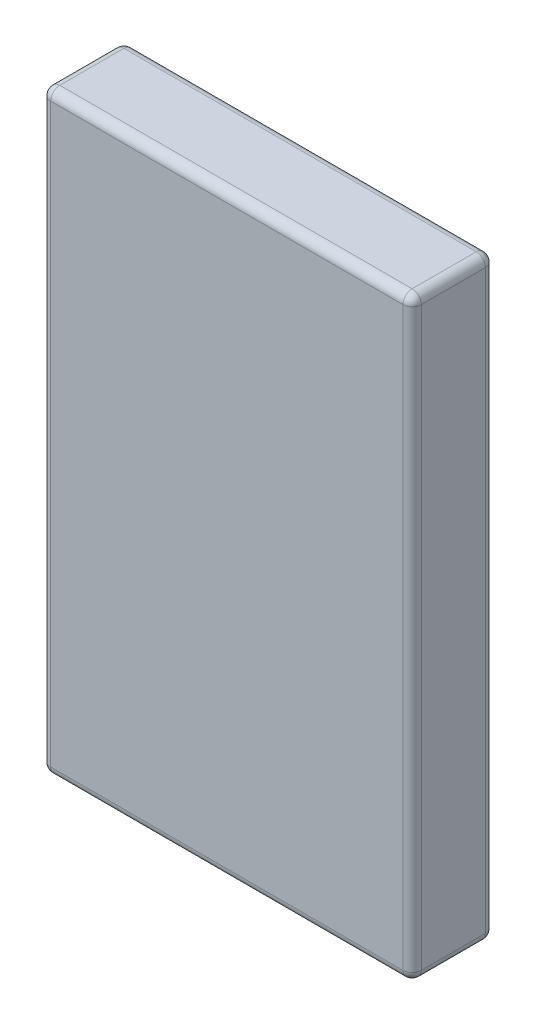
ISO-10303-21;
HEADER;
FILE_DESCRIPTION(('STEP AP214'),'2;1');
FILE_NAME('part.step','',(''),(''),'','','');
FILE_SCHEMA(('AUTOMOTIVE_DESIGN { 1 0 10303 214 1 1 1 1 }'));
ENDSEC;
DATA;
#1=APPLICATION_CONTEXT('core data for automotive mechanical design processes');
#2=APPLICATION_PROTOCOL_DEFINITION('international standard','automotive_design',2000,#1);
#3=PRODUCT_CONTEXT('',#1,'mechanical');
#4=PRODUCT('Part','Part','',(#3));
#5=PRODUCT_RELATED_PRODUCT_CATEGORY('part','',(#4));
#6=PRODUCT_DEFINITION_FORMATION('','',#4);
#7=PRODUCT_DEFINITION_CONTEXT('part definition',#1,'design');
#8=PRODUCT_DEFINITION('design','',#6,#7);
#9=PRODUCT_DEFINITION_SHAPE('','',#8);
#10=(LENGTH_UNIT() NAMED_UNIT(*) SI_UNIT(.MILLI.,.METRE.));
#11=(NAMED_UNIT(*) PLANE_ANGLE_UNIT() SI_UNIT($,.RADIAN.));
#12=(NAMED_UNIT(*) SI_UNIT($,.STERADIAN.) SOLID_ANGLE_UNIT());
#13=UNCERTAINTY_MEASURE_WITH_UNIT(LENGTH_MEASURE(1.E-05),#10,'distance_accuracy_value','');
#14=(GEOMETRIC_REPRESENTATION_CONTEXT(3) GLOBAL_UNCERTAINTY_ASSIGNED_CONTEXT((#13)) GLOBAL_UNIT_ASSIGNED_CONTEXT((#10,
#11,#12)) REPRESENTATION_CONTEXT('',''));
#15=CARTESIAN_POINT('',(0.,0.,0.));
#16=DIRECTION('',(0.,0.,1.));
#17=DIRECTION('',(1.,0.,0.));
#18=AXIS2_PLACEMENT_3D('',#15,#16,#17);
#19=CARTESIAN_POINT('',(81.,260.,-18.));
#20=DIRECTION('',(-1.,0.,0.));
#21=DIRECTION('',(0.,0.,1.));
#22=AXIS2_PLACEMENT_3D('',#19,#20,#21);
#23=PLANE('',#22);
#24=DIRECTION('',(0.,0.,-1.));
#25=VECTOR('',#24,1.);
#26=CARTESIAN_POINT('',(81.,4.,-18.));
#27=LINE('',#26,#25);
#28=CARTESIAN_POINT('',(81.,4.,14.));
#29=VERTEX_POINT('',#28);
#30=CARTESIAN_POINT('',(81.,4.,-14.));
#31=VERTEX_POINT('',#30);
#32=EDGE_CURVE('E43',#29,#31,#27,.T.);
#33=ORIENTED_EDGE('',*,*,#32,.T.);
#34=DIRECTION('',(0.,-1.,0.));
#35=VECTOR('',#34,1.);
#36=CARTESIAN_POINT('',(81.,260.,-14.));
#37=LINE('',#36,#35);
#38=CARTESIAN_POINT('',(81.,256.,-14.));
#39=VERTEX_POINT('',#38);
#40=EDGE_CURVE('E11',#31,#39,#37,.F.);
#41=ORIENTED_EDGE('',*,*,#40,.T.);
#42=DIRECTION('',(0.,0.,-1.));
#43=VECTOR('',#42,1.);
#44=CARTESIAN_POINT('',(81.,256.,18.));
#45=LINE('',#44,#43);
#46=CARTESIAN_POINT('',(81.,256.,14.));
#47=VERTEX_POINT('',#46);
#48=EDGE_CURVE('E201',#39,#47,#45,.F.);
#49=ORIENTED_EDGE('',*,*,#48,.T.);
#50=DIRECTION('',(0.,-1.,0.));
#51=VECTOR('',#50,1.);
#52=CARTESIAN_POINT('',(81.,260.,14.));
#53=LINE('',#52,#51);
#54=EDGE_CURVE('E199',#47,#29,#53,.T.);
#55=ORIENTED_EDGE('',*,*,#54,.T.);
#56=EDGE_LOOP('',(#33,#41,#49,#55));
#57=FACE_BOUND('',#56,.T.);
#58=ADVANCED_FACE('F34',(#57),#23,.F.);
#59=CARTESIAN_POINT('',(-81.,260.,-18.));
#60=DIRECTION('',(0.,0.,1.));
#61=DIRECTION('',(1.,0.,0.));
#62=AXIS2_PLACEMENT_3D('',#59,#60,#61);
#63=PLANE('',#62);
#64=DIRECTION('',(-1.,0.,0.));
#65=VECTOR('',#64,1.);
#66=CARTESIAN_POINT('',(-81.,4.,-18.));
#67=LINE('',#66,#65);
#68=CARTESIAN_POINT('',(77.,4.,-18.));
#69=VERTEX_POINT('',#68);
#70=CARTESIAN_POINT('',(-77.,4.,-18.));
#71=VERTEX_POINT('',#70);
#72=EDGE_CURVE('E169',#69,#71,#67,.T.);
#73=ORIENTED_EDGE('',*,*,#72,.T.);
#74=DIRECTION('',(0.,-1.,0.));
#75=VECTOR('',#74,1.);
#76=CARTESIAN_POINT('',(-77.,260.,-18.));
#77=LINE('',#76,#75);
#78=CARTESIAN_POINT('',(-77.,256.,-18.));
#79=VERTEX_POINT('',#78);
#80=EDGE_CURVE('E133',#71,#79,#77,.F.);
#81=ORIENTED_EDGE('',*,*,#80,.T.);
#82=DIRECTION('',(-1.,0.,0.));
#83=VECTOR('',#82,1.);
#84=CARTESIAN_POINT('',(81.,256.,-18.));
#85=LINE('',#84,#83);
#86=CARTESIAN_POINT('',(77.,256.,-18.));
#87=VERTEX_POINT('',#86);
#88=EDGE_CURVE('E161',#79,#87,#85,.F.);
#89=ORIENTED_EDGE('',*,*,#88,.T.);
#90=DIRECTION('',(0.,-1.,0.));
#91=VECTOR('',#90,1.);
#92=CARTESIAN_POINT('',(77.,260.,-18.));
#93=LINE('',#92,#91);
#94=EDGE_CURVE('E163',#87,#69,#93,.T.);
#95=ORIENTED_EDGE('',*,*,#94,.T.);
#96=EDGE_LOOP('',(#73,#81,#89,#95));
#97=FACE_BOUND('',#96,.T.);
#98=ADVANCED_FACE('F301',(#97),#63,.F.);
#99=CARTESIAN_POINT('',(-81.,260.,-18.));
#100=DIRECTION('',(1.,0.,0.));
#101=DIRECTION('',(0.,0.,-1.));
#102=AXIS2_PLACEMENT_3D('',#99,#100,#101);
#103=PLANE('',#102);
#104=DIRECTION('',(0.,0.,1.));
#105=VECTOR('',#104,1.);
#106=CARTESIAN_POINT('',(-81.,256.,-18.));
#107=LINE('',#106,#105);
#108=CARTESIAN_POINT('',(-81.,256.,14.));
#109=VERTEX_POINT('',#108);
#110=CARTESIAN_POINT('',(-81.,256.,-14.));
#111=VERTEX_POINT('',#110);
#112=EDGE_CURVE('E159',#109,#111,#107,.F.);
#113=ORIENTED_EDGE('',*,*,#112,.T.);
#114=DIRECTION('',(0.,-1.,0.));
#115=VECTOR('',#114,1.);
#116=CARTESIAN_POINT('',(-81.,260.,-14.));
#117=LINE('',#116,#115);
#118=CARTESIAN_POINT('',(-81.,4.,-14.));
#119=VERTEX_POINT('',#118);
#120=EDGE_CURVE('E131',#111,#119,#117,.T.);
#121=ORIENTED_EDGE('',*,*,#120,.T.);
#122=DIRECTION('',(0.,0.,1.));
#123=VECTOR('',#122,1.);
#124=CARTESIAN_POINT('',(-81.,4.,-18.));
#125=LINE('',#124,#123);
#126=CARTESIAN_POINT('',(-81.,4.,14.));
#127=VERTEX_POINT('',#126);
#128=EDGE_CURVE('E149',#119,#127,#125,.T.);
#129=ORIENTED_EDGE('',*,*,#128,.T.);
#130=DIRECTION('',(0.,-1.,0.));
#131=VECTOR('',#130,1.);
#132=CARTESIAN_POINT('',(-81.,260.,14.));
#133=LINE('',#132,#131);
#134=EDGE_CURVE('E155',#127,#109,#133,.F.);
#135=ORIENTED_EDGE('',*,*,#134,.T.);
#136=EDGE_LOOP('',(#113,#121,#129,#135));
#137=FACE_BOUND('',#136,.T.);
#138=ADVANCED_FACE('F157',(#137),#103,.F.);
#139=CARTESIAN_POINT('',(-81.,260.,18.));
#140=DIRECTION('',(0.,0.,-1.));
#141=DIRECTION('',(-1.,0.,0.));
#142=AXIS2_PLACEMENT_3D('',#139,#140,#141);
#143=PLANE('',#142);
#144=DIRECTION('',(1.,0.,0.));
#145=VECTOR('',#144,1.);
#146=CARTESIAN_POINT('',(-81.,256.,18.));
#147=LINE('',#146,#145);
#148=CARTESIAN_POINT('',(77.,256.,18.));
#149=VERTEX_POINT('',#148);
#150=CARTESIAN_POINT('',(-77.,256.,18.));
#151=VERTEX_POINT('',#150);
#152=EDGE_CURVE('E181',#149,#151,#147,.F.);
#153=ORIENTED_EDGE('',*,*,#152,.T.);
#154=DIRECTION('',(0.,-1.,0.));
#155=VECTOR('',#154,1.);
#156=CARTESIAN_POINT('',(-77.,260.,18.));
#157=LINE('',#156,#155);
#158=CARTESIAN_POINT('',(-77.,4.,18.));
#159=VERTEX_POINT('',#158);
#160=EDGE_CURVE('E187',#151,#159,#157,.T.);
#161=ORIENTED_EDGE('',*,*,#160,.T.);
#162=DIRECTION('',(1.,0.,0.));
#163=VECTOR('',#162,1.);
#164=CARTESIAN_POINT('',(-81.,4.,18.));
#165=LINE('',#164,#163);
#166=CARTESIAN_POINT('',(77.,4.,18.));
#167=VERTEX_POINT('',#166);
#168=EDGE_CURVE('E185',#159,#167,#165,.T.);
#169=ORIENTED_EDGE('',*,*,#168,.T.);
#170=DIRECTION('',(0.,-1.,0.));
#171=VECTOR('',#170,1.);
#172=CARTESIAN_POINT('',(77.,260.,18.));
#173=LINE('',#172,#171);
#174=EDGE_CURVE('E183',#167,#149,#173,.F.);
#175=ORIENTED_EDGE('',*,*,#174,.T.);
#176=EDGE_LOOP('',(#153,#161,#169,#175));
#177=FACE_BOUND('',#176,.T.);
#178=ADVANCED_FACE('F283',(#177),#143,.F.);
#179=CARTESIAN_POINT('',(0.,260.,0.));
#180=DIRECTION('',(0.,1.,0.));
#181=DIRECTION('',(0.,0.,1.));
#182=AXIS2_PLACEMENT_3D('',#179,#180,#181);
#183=PLANE('',#182);
#184=DIRECTION('',(0.,0.,-1.));
#185=VECTOR('',#184,1.);
#186=CARTESIAN_POINT('',(77.,260.,-18.));
#187=LINE('',#186,#185);
#188=CARTESIAN_POINT('',(77.,260.,14.));
#189=VERTEX_POINT('',#188);
#190=CARTESIAN_POINT('',(77.,260.,-14.));
#191=VERTEX_POINT('',#190);
#192=EDGE_CURVE('E174',#189,#191,#187,.T.);
#193=ORIENTED_EDGE('',*,*,#192,.T.);
#194=DIRECTION('',(-1.,0.,0.));
#195=VECTOR('',#194,1.);
#196=CARTESIAN_POINT('',(-81.,260.,-14.));
#197=LINE('',#196,#195);
#198=CARTESIAN_POINT('',(-77.,260.,-14.));
#199=VERTEX_POINT('',#198);
#200=EDGE_CURVE('E179',#191,#199,#197,.T.);
#201=ORIENTED_EDGE('',*,*,#200,.T.);
#202=DIRECTION('',(0.,0.,1.));
#203=VECTOR('',#202,1.);
#204=CARTESIAN_POINT('',(-77.,260.,18.));
#205=LINE('',#204,#203);
#206=CARTESIAN_POINT('',(-77.,260.,14.));
#207=VERTEX_POINT('',#206);
#208=EDGE_CURVE('E176',#199,#207,#205,.T.);
#209=ORIENTED_EDGE('',*,*,#208,.T.);
#210=DIRECTION('',(1.,0.,0.));
#211=VECTOR('',#210,1.);
#212=CARTESIAN_POINT('',(81.,260.,14.));
#213=LINE('',#212,#211);
#214=EDGE_CURVE('E172',#207,#189,#213,.T.);
#215=ORIENTED_EDGE('',*,*,#214,.T.);
#216=EDGE_LOOP('',(#193,#201,#209,#215));
#217=FACE_BOUND('',#216,.T.);
#218=ADVANCED_FACE('F274',(#217),#183,.T.);
#219=CARTESIAN_POINT('',(0.,0.,0.));
#220=DIRECTION('',(0.,1.,0.));
#221=DIRECTION('',(0.,0.,1.));
#222=AXIS2_PLACEMENT_3D('',#219,#220,#221);
#223=PLANE('',#222);
#224=DIRECTION('',(0.,0.,1.));
#225=VECTOR('',#224,1.);
#226=CARTESIAN_POINT('',(-77.,0.,0.));
#227=LINE('',#226,#225);
#228=CARTESIAN_POINT('',(-77.,0.,14.));
#229=VERTEX_POINT('',#228);
#230=CARTESIAN_POINT('',(-77.,0.,-14.));
#231=VERTEX_POINT('',#230);
#232=EDGE_CURVE('E194',#229,#231,#227,.F.);
#233=ORIENTED_EDGE('',*,*,#232,.T.);
#234=DIRECTION('',(-1.,0.,0.));
#235=VECTOR('',#234,1.);
#236=CARTESIAN_POINT('',(0.,0.,-14.));
#237=LINE('',#236,#235);
#238=CARTESIAN_POINT('',(77.,0.,-14.));
#239=VERTEX_POINT('',#238);
#240=EDGE_CURVE('E197',#231,#239,#237,.F.);
#241=ORIENTED_EDGE('',*,*,#240,.T.);
#242=DIRECTION('',(0.,0.,-1.));
#243=VECTOR('',#242,1.);
#244=CARTESIAN_POINT('',(77.,0.,0.));
#245=LINE('',#244,#243);
#246=CARTESIAN_POINT('',(77.,0.,14.));
#247=VERTEX_POINT('',#246);
#248=EDGE_CURVE('E192',#239,#247,#245,.F.);
#249=ORIENTED_EDGE('',*,*,#248,.T.);
#250=DIRECTION('',(1.,0.,0.));
#251=VECTOR('',#250,1.);
#252=CARTESIAN_POINT('',(0.,0.,14.));
#253=LINE('',#252,#251);
#254=EDGE_CURVE('E190',#247,#229,#253,.F.);
#255=ORIENTED_EDGE('',*,*,#254,.T.);
#256=EDGE_LOOP('',(#233,#241,#249,#255));
#257=FACE_BOUND('',#256,.T.);
#258=ADVANCED_FACE('F365',(#257),#223,.F.);
#259=CARTESIAN_POINT('',(77.,260.,14.));
#260=DIRECTION('',(0.,-1.,0.));
#261=DIRECTION('',(0.,0.,-1.));
#262=AXIS2_PLACEMENT_3D('',#259,#260,#261);
#263=CYLINDRICAL_SURFACE('',#262,4.);
#264=CARTESIAN_POINT('',(77.,256.,14.));
#265=DIRECTION('',(0.,1.,0.));
#266=DIRECTION('',(0.,0.,1.));
#267=AXIS2_PLACEMENT_3D('',#264,#265,#266);
#268=CIRCLE('',#267,4.);
#269=EDGE_CURVE('E38',#149,#47,#268,.T.);
#270=ORIENTED_EDGE('',*,*,#269,.F.);
#271=ORIENTED_EDGE('',*,*,#174,.F.);
#272=CARTESIAN_POINT('',(77.,4.,14.));
#273=DIRECTION('',(0.,-1.,0.));
#274=DIRECTION('',(0.,0.,-1.));
#275=AXIS2_PLACEMENT_3D('',#272,#273,#274);
#276=CIRCLE('',#275,4.);
#277=EDGE_CURVE('E251',#29,#167,#276,.T.);
#278=ORIENTED_EDGE('',*,*,#277,.F.);
#279=ORIENTED_EDGE('',*,*,#54,.F.);
#280=EDGE_LOOP('',(#270,#271,#278,#279));
#281=FACE_BOUND('',#280,.T.);
#282=ADVANCED_FACE('F36',(#281),#263,.T.);
#283=CARTESIAN_POINT('',(77.,256.,14.));
#284=DIRECTION('',(0.,0.,1.));
#285=DIRECTION('',(1.,0.,0.));
#286=AXIS2_PLACEMENT_3D('',#283,#284,#285);
#287=SPHERICAL_SURFACE('',#286,4.);
#288=CARTESIAN_POINT('',(77.,256.,14.));
#289=DIRECTION('',(1.,0.,0.));
#290=DIRECTION('',(0.,0.,-1.));
#291=AXIS2_PLACEMENT_3D('',#288,#289,#290);
#292=CIRCLE('',#291,4.);
#293=EDGE_CURVE('E246',#149,#189,#292,.F.);
#294=ORIENTED_EDGE('',*,*,#293,.F.);
#295=ORIENTED_EDGE('',*,*,#269,.T.);
#296=CARTESIAN_POINT('',(77.,256.,14.));
#297=DIRECTION('',(0.,0.,1.));
#298=DIRECTION('',(0.,-1.,0.));
#299=AXIS2_PLACEMENT_3D('',#296,#297,#298);
#300=CIRCLE('',#299,4.);
#301=EDGE_CURVE('E249',#189,#47,#300,.F.);
#302=ORIENTED_EDGE('',*,*,#301,.F.);
#303=EDGE_LOOP('',(#294,#295,#302));
#304=FACE_BOUND('',#303,.T.);
#305=ADVANCED_FACE('F262',(#304),#287,.T.);
#306=CARTESIAN_POINT('',(77.,4.,14.));
#307=DIRECTION('',(0.,0.,1.));
#308=DIRECTION('',(1.,0.,0.));
#309=AXIS2_PLACEMENT_3D('',#306,#307,#308);
#310=SPHERICAL_SURFACE('',#309,4.);
#311=CARTESIAN_POINT('',(77.,4.,14.));
#312=DIRECTION('',(0.,0.,1.));
#313=DIRECTION('',(1.,0.,0.));
#314=AXIS2_PLACEMENT_3D('',#311,#312,#313);
#315=CIRCLE('',#314,4.);
#316=EDGE_CURVE('E240',#29,#247,#315,.F.);
#317=ORIENTED_EDGE('',*,*,#316,.F.);
#318=ORIENTED_EDGE('',*,*,#277,.T.);
#319=CARTESIAN_POINT('',(77.,4.,14.));
#320=DIRECTION('',(1.,0.,0.));
#321=DIRECTION('',(0.,0.,-1.));
#322=AXIS2_PLACEMENT_3D('',#319,#320,#321);
#323=CIRCLE('',#322,4.);
#324=EDGE_CURVE('E243',#247,#167,#323,.F.);
#325=ORIENTED_EDGE('',*,*,#324,.F.);
#326=EDGE_LOOP('',(#317,#318,#325));
#327=FACE_BOUND('',#326,.T.);
#328=ADVANCED_FACE('F296',(#327),#310,.T.);
#329=CARTESIAN_POINT('',(77.,256.,0.));
#330=DIRECTION('',(0.,0.,1.));
#331=DIRECTION('',(1.,0.,0.));
#332=AXIS2_PLACEMENT_3D('',#329,#330,#331);
#333=CYLINDRICAL_SURFACE('',#332,4.);
#334=ORIENTED_EDGE('',*,*,#301,.T.);
#335=ORIENTED_EDGE('',*,*,#48,.F.);
#336=CARTESIAN_POINT('',(77.,256.,-14.));
#337=DIRECTION('',(0.,0.,-1.));
#338=DIRECTION('',(-1.,0.,0.));
#339=AXIS2_PLACEMENT_3D('',#336,#337,#338);
#340=CIRCLE('',#339,4.);
#341=EDGE_CURVE('E234',#191,#39,#340,.T.);
#342=ORIENTED_EDGE('',*,*,#341,.F.);
#343=ORIENTED_EDGE('',*,*,#192,.F.);
#344=EDGE_LOOP('',(#334,#335,#342,#343));
#345=FACE_BOUND('',#344,.T.);
#346=ADVANCED_FACE('F269',(#345),#333,.T.);
#347=CARTESIAN_POINT('',(0.,256.,14.));
#348=DIRECTION('',(-1.,0.,0.));
#349=DIRECTION('',(0.,0.,1.));
#350=AXIS2_PLACEMENT_3D('',#347,#348,#349);
#351=CYLINDRICAL_SURFACE('',#350,4.);
#352=ORIENTED_EDGE('',*,*,#293,.T.);
#353=ORIENTED_EDGE('',*,*,#214,.F.);
#354=CARTESIAN_POINT('',(-77.,256.,14.));
#355=DIRECTION('',(-1.,0.,0.));
#356=DIRECTION('',(0.,0.,1.));
#357=AXIS2_PLACEMENT_3D('',#354,#355,#356);
#358=CIRCLE('',#357,4.);
#359=EDGE_CURVE('E231',#151,#207,#358,.T.);
#360=ORIENTED_EDGE('',*,*,#359,.F.);
#361=ORIENTED_EDGE('',*,*,#152,.F.);
#362=EDGE_LOOP('',(#352,#353,#360,#361));
#363=FACE_BOUND('',#362,.T.);
#364=ADVANCED_FACE('F280',(#363),#351,.T.);
#365=CARTESIAN_POINT('',(-77.,260.,14.));
#366=DIRECTION('',(0.,-1.,0.));
#367=DIRECTION('',(0.,0.,-1.));
#368=AXIS2_PLACEMENT_3D('',#365,#366,#367);
#369=CYLINDRICAL_SURFACE('',#368,4.);
#370=CARTESIAN_POINT('',(-77.,4.,14.));
#371=DIRECTION('',(0.,-1.,0.));
#372=DIRECTION('',(0.,0.,-1.));
#373=AXIS2_PLACEMENT_3D('',#370,#371,#372);
#374=CIRCLE('',#373,4.);
#375=EDGE_CURVE('E225',#159,#127,#374,.T.);
#376=ORIENTED_EDGE('',*,*,#375,.F.);
#377=ORIENTED_EDGE('',*,*,#160,.F.);
#378=CARTESIAN_POINT('',(-77.,256.,14.));
#379=DIRECTION('',(0.,1.,0.));
#380=DIRECTION('',(0.,0.,1.));
#381=AXIS2_PLACEMENT_3D('',#378,#379,#380);
#382=CIRCLE('',#381,4.);
#383=EDGE_CURVE('E228',#109,#151,#382,.T.);
#384=ORIENTED_EDGE('',*,*,#383,.F.);
#385=ORIENTED_EDGE('',*,*,#134,.F.);
#386=EDGE_LOOP('',(#376,#377,#384,#385));
#387=FACE_BOUND('',#386,.T.);
#388=ADVANCED_FACE('F287',(#387),#369,.T.);
#389=CARTESIAN_POINT('',(-81.,4.,14.));
#390=DIRECTION('',(1.,0.,0.));
#391=DIRECTION('',(0.,0.,-1.));
#392=AXIS2_PLACEMENT_3D('',#389,#390,#391);
#393=CYLINDRICAL_SURFACE('',#392,4.);
#394=ORIENTED_EDGE('',*,*,#324,.T.);
#395=ORIENTED_EDGE('',*,*,#168,.F.);
#396=CARTESIAN_POINT('',(-77.,4.,14.));
#397=DIRECTION('',(-1.,0.,0.));
#398=DIRECTION('',(0.,0.,1.));
#399=AXIS2_PLACEMENT_3D('',#396,#397,#398);
#400=CIRCLE('',#399,4.);
#401=EDGE_CURVE('E223',#229,#159,#400,.T.);
#402=ORIENTED_EDGE('',*,*,#401,.F.);
#403=ORIENTED_EDGE('',*,*,#254,.F.);
#404=EDGE_LOOP('',(#394,#395,#402,#403));
#405=FACE_BOUND('',#404,.T.);
#406=ADVANCED_FACE('F293',(#405),#393,.T.);
#407=CARTESIAN_POINT('',(77.,4.,-18.));
#408=DIRECTION('',(0.,0.,-1.));
#409=DIRECTION('',(-1.,0.,0.));
#410=AXIS2_PLACEMENT_3D('',#407,#408,#409);
#411=CYLINDRICAL_SURFACE('',#410,4.);
#412=ORIENTED_EDGE('',*,*,#316,.T.);
#413=ORIENTED_EDGE('',*,*,#248,.F.);
#414=CARTESIAN_POINT('',(77.,4.,-14.));
#415=DIRECTION('',(0.,0.,-1.));
#416=DIRECTION('',(-1.,0.,0.));
#417=AXIS2_PLACEMENT_3D('',#414,#415,#416);
#418=CIRCLE('',#417,4.);
#419=EDGE_CURVE('E221',#31,#239,#418,.T.);
#420=ORIENTED_EDGE('',*,*,#419,.F.);
#421=ORIENTED_EDGE('',*,*,#32,.F.);
#422=EDGE_LOOP('',(#412,#413,#420,#421));
#423=FACE_BOUND('',#422,.T.);
#424=ADVANCED_FACE('F299',(#423),#411,.T.);
#425=CARTESIAN_POINT('',(77.,260.,-14.));
#426=DIRECTION('',(0.,-1.,0.));
#427=DIRECTION('',(0.,0.,-1.));
#428=AXIS2_PLACEMENT_3D('',#425,#426,#427);
#429=CYLINDRICAL_SURFACE('',#428,4.);
#430=CARTESIAN_POINT('',(77.,256.,-14.));
#431=DIRECTION('',(0.,1.,0.));
#432=DIRECTION('',(0.,0.,1.));
#433=AXIS2_PLACEMENT_3D('',#430,#431,#432);
#434=CIRCLE('',#433,4.);
#435=EDGE_CURVE('E237',#39,#87,#434,.T.);
#436=ORIENTED_EDGE('',*,*,#435,.F.);
#437=ORIENTED_EDGE('',*,*,#40,.F.);
#438=CARTESIAN_POINT('',(77.,4.,-14.));
#439=DIRECTION('',(0.,-1.,0.));
#440=DIRECTION('',(0.,0.,-1.));
#441=AXIS2_PLACEMENT_3D('',#438,#439,#440);
#442=CIRCLE('',#441,4.);
#443=EDGE_CURVE('E51',#69,#31,#442,.T.);
#444=ORIENTED_EDGE('',*,*,#443,.F.);
#445=ORIENTED_EDGE('',*,*,#94,.F.);
#446=EDGE_LOOP('',(#436,#437,#444,#445));
#447=FACE_BOUND('',#446,.T.);
#448=ADVANCED_FACE('F345',(#447),#429,.T.);
#449=CARTESIAN_POINT('',(77.,256.,-14.));
#450=DIRECTION('',(0.,0.,1.));
#451=DIRECTION('',(1.,0.,0.));
#452=AXIS2_PLACEMENT_3D('',#449,#450,#451);
#453=SPHERICAL_SURFACE('',#452,4.);
#454=ORIENTED_EDGE('',*,*,#341,.T.);
#455=ORIENTED_EDGE('',*,*,#435,.T.);
#456=CARTESIAN_POINT('',(77.,256.,-14.));
#457=DIRECTION('',(1.,0.,0.));
#458=DIRECTION('',(0.,0.,-1.));
#459=AXIS2_PLACEMENT_3D('',#456,#457,#458);
#460=CIRCLE('',#459,4.);
#461=EDGE_CURVE('E217',#191,#87,#460,.F.);
#462=ORIENTED_EDGE('',*,*,#461,.F.);
#463=EDGE_LOOP('',(#454,#455,#462));
#464=FACE_BOUND('',#463,.T.);
#465=ADVANCED_FACE('F341',(#464),#453,.T.);
#466=CARTESIAN_POINT('',(-77.,256.,14.));
#467=DIRECTION('',(0.,0.,1.));
#468=DIRECTION('',(1.,0.,0.));
#469=AXIS2_PLACEMENT_3D('',#466,#467,#468);
#470=SPHERICAL_SURFACE('',#469,4.);
#471=ORIENTED_EDGE('',*,*,#383,.T.);
#472=ORIENTED_EDGE('',*,*,#359,.T.);
#473=CARTESIAN_POINT('',(-77.,256.,14.));
#474=DIRECTION('',(0.,0.,1.));
#475=DIRECTION('',(1.,0.,0.));
#476=AXIS2_PLACEMENT_3D('',#473,#474,#475);
#477=CIRCLE('',#476,4.);
#478=EDGE_CURVE('E215',#109,#207,#477,.F.);
#479=ORIENTED_EDGE('',*,*,#478,.F.);
#480=EDGE_LOOP('',(#471,#472,#479));
#481=FACE_BOUND('',#480,.T.);
#482=ADVANCED_FACE('F338',(#481),#470,.T.);
#483=CARTESIAN_POINT('',(-77.,4.,14.));
#484=DIRECTION('',(0.,0.,1.));
#485=DIRECTION('',(1.,0.,0.));
#486=AXIS2_PLACEMENT_3D('',#483,#484,#485);
#487=SPHERICAL_SURFACE('',#486,4.);
#488=ORIENTED_EDGE('',*,*,#401,.T.);
#489=ORIENTED_EDGE('',*,*,#375,.T.);
#490=CARTESIAN_POINT('',(-77.,4.,14.));
#491=DIRECTION('',(0.,0.,1.));
#492=DIRECTION('',(1.,0.,0.));
#493=AXIS2_PLACEMENT_3D('',#490,#491,#492);
#494=CIRCLE('',#493,4.);
#495=EDGE_CURVE('E152',#229,#127,#494,.F.);
#496=ORIENTED_EDGE('',*,*,#495,.F.);
#497=EDGE_LOOP('',(#488,#489,#496));
#498=FACE_BOUND('',#497,.T.);
#499=ADVANCED_FACE('F335',(#498),#487,.T.);
#500=CARTESIAN_POINT('',(77.,4.,-14.));
#501=DIRECTION('',(0.,0.,1.));
#502=DIRECTION('',(1.,0.,0.));
#503=AXIS2_PLACEMENT_3D('',#500,#501,#502);
#504=SPHERICAL_SURFACE('',#503,4.);
#505=ORIENTED_EDGE('',*,*,#443,.T.);
#506=ORIENTED_EDGE('',*,*,#419,.T.);
#507=CARTESIAN_POINT('',(77.,4.,-14.));
#508=DIRECTION('',(1.,0.,0.));
#509=DIRECTION('',(0.,0.,-1.));
#510=AXIS2_PLACEMENT_3D('',#507,#508,#509);
#511=CIRCLE('',#510,4.);
#512=EDGE_CURVE('E211',#69,#239,#511,.F.);
#513=ORIENTED_EDGE('',*,*,#512,.F.);
#514=EDGE_LOOP('',(#505,#506,#513));
#515=FACE_BOUND('',#514,.T.);
#516=ADVANCED_FACE('F331',(#515),#504,.T.);
#517=CARTESIAN_POINT('',(0.,256.,-14.));
#518=DIRECTION('',(1.,0.,0.));
#519=DIRECTION('',(0.,0.,-1.));
#520=AXIS2_PLACEMENT_3D('',#517,#518,#519);
#521=CYLINDRICAL_SURFACE('',#520,4.);
#522=ORIENTED_EDGE('',*,*,#461,.T.);
#523=ORIENTED_EDGE('',*,*,#88,.F.);
#524=CARTESIAN_POINT('',(-77.,256.,-14.));
#525=DIRECTION('',(-1.,0.,0.));
#526=DIRECTION('',(0.,0.,1.));
#527=AXIS2_PLACEMENT_3D('',#524,#525,#526);
#528=CIRCLE('',#527,4.);
#529=EDGE_CURVE('E208',#199,#79,#528,.T.);
#530=ORIENTED_EDGE('',*,*,#529,.F.);
#531=ORIENTED_EDGE('',*,*,#200,.F.);
#532=EDGE_LOOP('',(#522,#523,#530,#531));
#533=FACE_BOUND('',#532,.T.);
#534=ADVANCED_FACE('F327',(#533),#521,.T.);
#535=CARTESIAN_POINT('',(-77.,256.,0.));
#536=DIRECTION('',(0.,0.,-1.));
#537=DIRECTION('',(-1.,0.,0.));
#538=AXIS2_PLACEMENT_3D('',#535,#536,#537);
#539=CYLINDRICAL_SURFACE('',#538,4.);
#540=ORIENTED_EDGE('',*,*,#478,.T.);
#541=ORIENTED_EDGE('',*,*,#208,.F.);
#542=CARTESIAN_POINT('',(-77.,256.,-14.));
#543=DIRECTION('',(0.,0.,-1.));
#544=DIRECTION('',(-1.,0.,0.));
#545=AXIS2_PLACEMENT_3D('',#542,#543,#544);
#546=CIRCLE('',#545,4.);
#547=EDGE_CURVE('E146',#111,#199,#546,.T.);
#548=ORIENTED_EDGE('',*,*,#547,.F.);
#549=ORIENTED_EDGE('',*,*,#112,.F.);
#550=EDGE_LOOP('',(#540,#541,#548,#549));
#551=FACE_BOUND('',#550,.T.);
#552=ADVANCED_FACE('F324',(#551),#539,.T.);
#553=CARTESIAN_POINT('',(-77.,4.,-18.));
#554=DIRECTION('',(0.,0.,1.));
#555=DIRECTION('',(1.,0.,0.));
#556=AXIS2_PLACEMENT_3D('',#553,#554,#555);
#557=CYLINDRICAL_SURFACE('',#556,4.);
#558=ORIENTED_EDGE('',*,*,#495,.T.);
#559=ORIENTED_EDGE('',*,*,#128,.F.);
#560=CARTESIAN_POINT('',(-77.,4.,-14.));
#561=DIRECTION('',(0.,0.,-1.));
#562=DIRECTION('',(-1.,0.,0.));
#563=AXIS2_PLACEMENT_3D('',#560,#561,#562);
#564=CIRCLE('',#563,4.);
#565=EDGE_CURVE('E138',#231,#119,#564,.T.);
#566=ORIENTED_EDGE('',*,*,#565,.F.);
#567=ORIENTED_EDGE('',*,*,#232,.F.);
#568=EDGE_LOOP('',(#558,#559,#566,#567));
#569=FACE_BOUND('',#568,.T.);
#570=ADVANCED_FACE('F150',(#569),#557,.T.);
#571=CARTESIAN_POINT('',(-81.,4.,-14.));
#572=DIRECTION('',(-1.,0.,0.));
#573=DIRECTION('',(0.,0.,1.));
#574=AXIS2_PLACEMENT_3D('',#571,#572,#573);
#575=CYLINDRICAL_SURFACE('',#574,4.);
#576=ORIENTED_EDGE('',*,*,#512,.T.);
#577=ORIENTED_EDGE('',*,*,#240,.F.);
#578=CARTESIAN_POINT('',(-77.,4.,-14.));
#579=DIRECTION('',(-1.,0.,0.));
#580=DIRECTION('',(0.,0.,1.));
#581=AXIS2_PLACEMENT_3D('',#578,#579,#580);
#582=CIRCLE('',#581,4.);
#583=EDGE_CURVE('E142',#71,#231,#582,.T.);
#584=ORIENTED_EDGE('',*,*,#583,.F.);
#585=ORIENTED_EDGE('',*,*,#72,.F.);
#586=EDGE_LOOP('',(#576,#577,#584,#585));
#587=FACE_BOUND('',#586,.T.);
#588=ADVANCED_FACE('F317',(#587),#575,.T.);
#589=CARTESIAN_POINT('',(-77.,256.,-14.));
#590=DIRECTION('',(0.,0.,1.));
#591=DIRECTION('',(1.,0.,0.));
#592=AXIS2_PLACEMENT_3D('',#589,#590,#591);
#593=SPHERICAL_SURFACE('',#592,4.);
#594=ORIENTED_EDGE('',*,*,#547,.T.);
#595=ORIENTED_EDGE('',*,*,#529,.T.);
#596=CARTESIAN_POINT('',(-77.,256.,-14.));
#597=DIRECTION('',(0.,1.,0.));
#598=DIRECTION('',(0.,0.,1.));
#599=AXIS2_PLACEMENT_3D('',#596,#597,#598);
#600=CIRCLE('',#599,4.);
#601=EDGE_CURVE('E135',#111,#79,#600,.F.);
#602=ORIENTED_EDGE('',*,*,#601,.F.);
#603=EDGE_LOOP('',(#594,#595,#602));
#604=FACE_BOUND('',#603,.T.);
#605=ADVANCED_FACE('F314',(#604),#593,.T.);
#606=CARTESIAN_POINT('',(-77.,4.,-14.));
#607=DIRECTION('',(0.,0.,1.));
#608=DIRECTION('',(1.,0.,0.));
#609=AXIS2_PLACEMENT_3D('',#606,#607,#608);
#610=SPHERICAL_SURFACE('',#609,4.);
#611=ORIENTED_EDGE('',*,*,#583,.T.);
#612=ORIENTED_EDGE('',*,*,#565,.T.);
#613=CARTESIAN_POINT('',(-77.,4.,-14.));
#614=DIRECTION('',(0.,-1.,0.));
#615=DIRECTION('',(0.,0.,-1.));
#616=AXIS2_PLACEMENT_3D('',#613,#614,#615);
#617=CIRCLE('',#616,4.);
#618=EDGE_CURVE('E127',#71,#119,#617,.F.);
#619=ORIENTED_EDGE('',*,*,#618,.F.);
#620=EDGE_LOOP('',(#611,#612,#619));
#621=FACE_BOUND('',#620,.T.);
#622=ADVANCED_FACE('F140',(#621),#610,.T.);
#623=CARTESIAN_POINT('',(-77.,260.,-14.));
#624=DIRECTION('',(0.,-1.,0.));
#625=DIRECTION('',(0.,0.,-1.));
#626=AXIS2_PLACEMENT_3D('',#623,#624,#625);
#627=CYLINDRICAL_SURFACE('',#626,4.);
#628=ORIENTED_EDGE('',*,*,#601,.T.);
#629=ORIENTED_EDGE('',*,*,#80,.F.);
#630=ORIENTED_EDGE('',*,*,#618,.T.);
#631=ORIENTED_EDGE('',*,*,#120,.F.);
#632=EDGE_LOOP('',(#628,#629,#630,#631));
#633=FACE_BOUND('',#632,.T.);
#634=ADVANCED_FACE('F129',(#633),#627,.T.);
#635=CLOSED_SHELL('',(#58,#98,#138,#178,#218,#258,#282,#305,#328,#346,#364,#388,#406,#424,#448,
#465,#482,#499,#516,#534,#552,#570,#588,#605,#622,#634));
#636=MANIFOLD_SOLID_BREP('B2',#635);
#637=ADVANCED_BREP_SHAPE_REPRESENTATION('',(#18,#636),#14);
#638=SHAPE_DEFINITION_REPRESENTATION(#9,#637);
ENDSEC;
END-ISO-10303-21;
